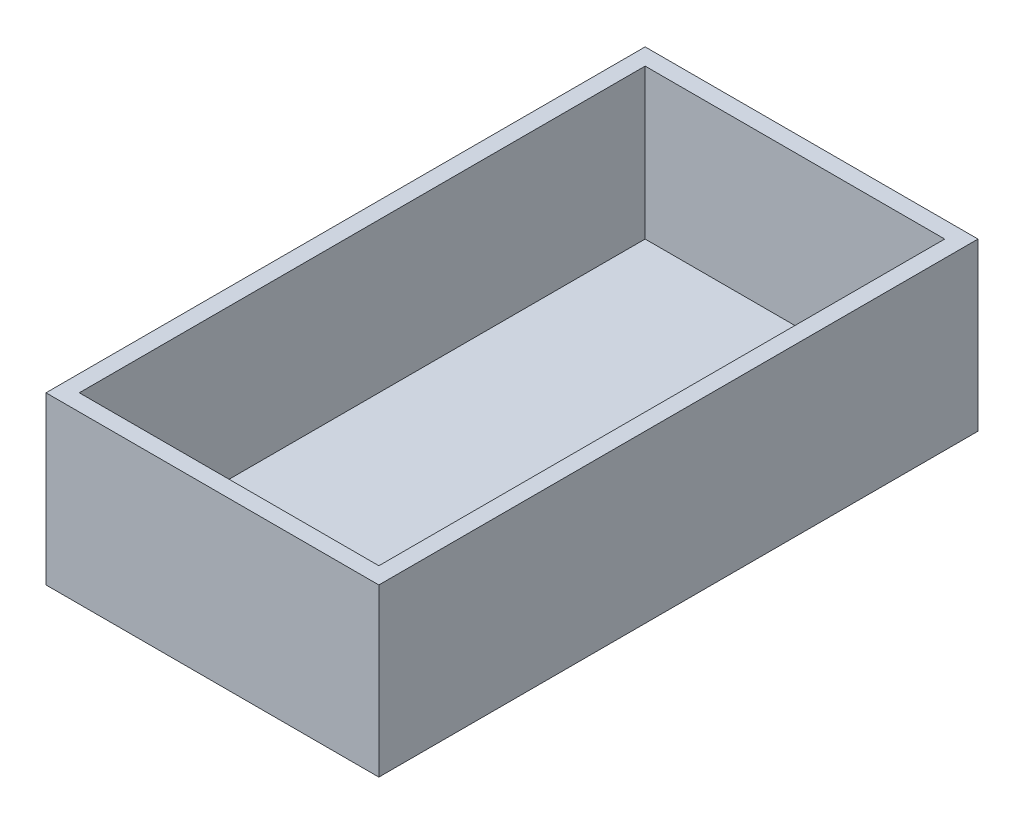
ISO-10303-21;
HEADER;
FILE_DESCRIPTION(('STEP AP214'),'2;1');
FILE_NAME('part.step','',(''),(''),'','','');
FILE_SCHEMA(('AUTOMOTIVE_DESIGN { 1 0 10303 214 1 1 1 1 }'));
ENDSEC;
DATA;
#1=APPLICATION_CONTEXT('core data for automotive mechanical design processes');
#2=APPLICATION_PROTOCOL_DEFINITION('international standard','automotive_design',2000,#1);
#3=PRODUCT_CONTEXT('',#1,'mechanical');
#4=PRODUCT('Part','Part','',(#3));
#5=PRODUCT_RELATED_PRODUCT_CATEGORY('part','',(#4));
#6=PRODUCT_DEFINITION_FORMATION('','',#4);
#7=PRODUCT_DEFINITION_CONTEXT('part definition',#1,'design');
#8=PRODUCT_DEFINITION('design','',#6,#7);
#9=PRODUCT_DEFINITION_SHAPE('','',#8);
#10=(LENGTH_UNIT() NAMED_UNIT(*) SI_UNIT(.MILLI.,.METRE.));
#11=(NAMED_UNIT(*) PLANE_ANGLE_UNIT() SI_UNIT($,.RADIAN.));
#12=(NAMED_UNIT(*) SI_UNIT($,.STERADIAN.) SOLID_ANGLE_UNIT());
#13=UNCERTAINTY_MEASURE_WITH_UNIT(LENGTH_MEASURE(1.E-05),#10,'distance_accuracy_value','');
#14=(GEOMETRIC_REPRESENTATION_CONTEXT(3) GLOBAL_UNCERTAINTY_ASSIGNED_CONTEXT((#13)) GLOBAL_UNIT_ASSIGNED_CONTEXT((#10,
#11,#12)) REPRESENTATION_CONTEXT('',''));
#15=CARTESIAN_POINT('',(0.,0.,0.));
#16=DIRECTION('',(0.,0.,1.));
#17=DIRECTION('',(1.,0.,0.));
#18=AXIS2_PLACEMENT_3D('',#15,#16,#17);
#19=CARTESIAN_POINT('',(20.,20.,-36.));
#20=DIRECTION('',(-1.,0.,0.));
#21=DIRECTION('',(0.,0.,1.));
#22=AXIS2_PLACEMENT_3D('',#19,#20,#21);
#23=PLANE('',#22);
#24=DIRECTION('',(0.,0.,-1.));
#25=VECTOR('',#24,1.);
#26=CARTESIAN_POINT('',(20.,0.,-36.));
#27=LINE('',#26,#25);
#28=CARTESIAN_POINT('',(20.,0.,36.));
#29=VERTEX_POINT('',#28);
#30=CARTESIAN_POINT('',(20.,0.,-36.));
#31=VERTEX_POINT('',#30);
#32=EDGE_CURVE('E147',#29,#31,#27,.T.);
#33=ORIENTED_EDGE('',*,*,#32,.T.);
#34=DIRECTION('',(0.,-1.,0.));
#35=VECTOR('',#34,1.);
#36=CARTESIAN_POINT('',(20.,20.,-36.));
#37=LINE('',#36,#35);
#38=CARTESIAN_POINT('',(20.,20.,-36.));
#39=VERTEX_POINT('',#38);
#40=EDGE_CURVE('E11',#39,#31,#37,.T.);
#41=ORIENTED_EDGE('',*,*,#40,.F.);
#42=DIRECTION('',(0.,0.,-1.));
#43=VECTOR('',#42,1.);
#44=CARTESIAN_POINT('',(20.,20.,-36.));
#45=LINE('',#44,#43);
#46=CARTESIAN_POINT('',(20.,20.,36.));
#47=VERTEX_POINT('',#46);
#48=EDGE_CURVE('E140',#47,#39,#45,.T.);
#49=ORIENTED_EDGE('',*,*,#48,.F.);
#50=DIRECTION('',(0.,-1.,0.));
#51=VECTOR('',#50,1.);
#52=CARTESIAN_POINT('',(20.,20.,36.));
#53=LINE('',#52,#51);
#54=EDGE_CURVE('E146',#47,#29,#53,.T.);
#55=ORIENTED_EDGE('',*,*,#54,.T.);
#56=EDGE_LOOP('',(#33,#41,#49,#55));
#57=FACE_BOUND('',#56,.T.);
#58=ADVANCED_FACE('F33',(#57),#23,.F.);
#59=CARTESIAN_POINT('',(-20.,20.,-36.));
#60=DIRECTION('',(0.,0.,1.));
#61=DIRECTION('',(1.,0.,0.));
#62=AXIS2_PLACEMENT_3D('',#59,#60,#61);
#63=PLANE('',#62);
#64=DIRECTION('',(-1.,0.,0.));
#65=VECTOR('',#64,1.);
#66=CARTESIAN_POINT('',(-20.,0.,-36.));
#67=LINE('',#66,#65);
#68=CARTESIAN_POINT('',(-20.,0.,-36.));
#69=VERTEX_POINT('',#68);
#70=EDGE_CURVE('E150',#31,#69,#67,.T.);
#71=ORIENTED_EDGE('',*,*,#70,.T.);
#72=DIRECTION('',(0.,-1.,0.));
#73=VECTOR('',#72,1.);
#74=CARTESIAN_POINT('',(-20.,20.,-36.));
#75=LINE('',#74,#73);
#76=CARTESIAN_POINT('',(-20.,20.,-36.));
#77=VERTEX_POINT('',#76);
#78=EDGE_CURVE('E40',#77,#69,#75,.T.);
#79=ORIENTED_EDGE('',*,*,#78,.F.);
#80=DIRECTION('',(-1.,0.,0.));
#81=VECTOR('',#80,1.);
#82=CARTESIAN_POINT('',(-20.,20.,-36.));
#83=LINE('',#82,#81);
#84=EDGE_CURVE('E84',#39,#77,#83,.T.);
#85=ORIENTED_EDGE('',*,*,#84,.F.);
#86=ORIENTED_EDGE('',*,*,#40,.T.);
#87=EDGE_LOOP('',(#71,#79,#85,#86));
#88=FACE_BOUND('',#87,.T.);
#89=ADVANCED_FACE('F179',(#88),#63,.F.);
#90=CARTESIAN_POINT('',(-20.,20.,-36.));
#91=DIRECTION('',(1.,0.,0.));
#92=DIRECTION('',(0.,0.,-1.));
#93=AXIS2_PLACEMENT_3D('',#90,#91,#92);
#94=PLANE('',#93);
#95=DIRECTION('',(0.,0.,1.));
#96=VECTOR('',#95,1.);
#97=CARTESIAN_POINT('',(-20.,0.,-36.));
#98=LINE('',#97,#96);
#99=CARTESIAN_POINT('',(-20.,0.,36.));
#100=VERTEX_POINT('',#99);
#101=EDGE_CURVE('E152',#69,#100,#98,.T.);
#102=ORIENTED_EDGE('',*,*,#101,.T.);
#103=DIRECTION('',(0.,-1.,0.));
#104=VECTOR('',#103,1.);
#105=CARTESIAN_POINT('',(-20.,20.,36.));
#106=LINE('',#105,#104);
#107=CARTESIAN_POINT('',(-20.,20.,36.));
#108=VERTEX_POINT('',#107);
#109=EDGE_CURVE('E156',#108,#100,#106,.T.);
#110=ORIENTED_EDGE('',*,*,#109,.F.);
#111=DIRECTION('',(0.,0.,1.));
#112=VECTOR('',#111,1.);
#113=CARTESIAN_POINT('',(-20.,20.,-36.));
#114=LINE('',#113,#112);
#115=EDGE_CURVE('E143',#77,#108,#114,.T.);
#116=ORIENTED_EDGE('',*,*,#115,.F.);
#117=ORIENTED_EDGE('',*,*,#78,.T.);
#118=EDGE_LOOP('',(#102,#110,#116,#117));
#119=FACE_BOUND('',#118,.T.);
#120=ADVANCED_FACE('F161',(#119),#94,.F.);
#121=CARTESIAN_POINT('',(-20.,20.,36.));
#122=DIRECTION('',(0.,0.,-1.));
#123=DIRECTION('',(-1.,0.,0.));
#124=AXIS2_PLACEMENT_3D('',#121,#122,#123);
#125=PLANE('',#124);
#126=DIRECTION('',(1.,0.,0.));
#127=VECTOR('',#126,1.);
#128=CARTESIAN_POINT('',(-20.,0.,36.));
#129=LINE('',#128,#127);
#130=EDGE_CURVE('E77',#100,#29,#129,.T.);
#131=ORIENTED_EDGE('',*,*,#130,.T.);
#132=ORIENTED_EDGE('',*,*,#54,.F.);
#133=DIRECTION('',(1.,0.,0.));
#134=VECTOR('',#133,1.);
#135=CARTESIAN_POINT('',(-20.,20.,36.));
#136=LINE('',#135,#134);
#137=EDGE_CURVE('E56',#108,#47,#136,.T.);
#138=ORIENTED_EDGE('',*,*,#137,.F.);
#139=ORIENTED_EDGE('',*,*,#109,.T.);
#140=EDGE_LOOP('',(#131,#132,#138,#139));
#141=FACE_BOUND('',#140,.T.);
#142=ADVANCED_FACE('F169',(#141),#125,.F.);
#143=CARTESIAN_POINT('',(0.,20.,0.));
#144=DIRECTION('',(0.,1.,0.));
#145=DIRECTION('',(0.,0.,1.));
#146=AXIS2_PLACEMENT_3D('',#143,#144,#145);
#147=PLANE('',#146);
#148=DIRECTION('',(0.,0.,-1.));
#149=VECTOR('',#148,1.);
#150=CARTESIAN_POINT('',(18.,20.,-36.));
#151=LINE('',#150,#149);
#152=CARTESIAN_POINT('',(18.,20.,34.));
#153=VERTEX_POINT('',#152);
#154=CARTESIAN_POINT('',(18.,20.,-34.));
#155=VERTEX_POINT('',#154);
#156=EDGE_CURVE('E129',#153,#155,#151,.T.);
#157=ORIENTED_EDGE('',*,*,#156,.F.);
#158=DIRECTION('',(1.,0.,0.));
#159=VECTOR('',#158,1.);
#160=CARTESIAN_POINT('',(-20.,20.,34.));
#161=LINE('',#160,#159);
#162=CARTESIAN_POINT('',(-18.,20.,34.));
#163=VERTEX_POINT('',#162);
#164=EDGE_CURVE('E138',#163,#153,#161,.T.);
#165=ORIENTED_EDGE('',*,*,#164,.F.);
#166=DIRECTION('',(0.,0.,1.));
#167=VECTOR('',#166,1.);
#168=CARTESIAN_POINT('',(-18.,20.,-36.));
#169=LINE('',#168,#167);
#170=CARTESIAN_POINT('',(-18.,20.,-34.));
#171=VERTEX_POINT('',#170);
#172=EDGE_CURVE('E136',#171,#163,#169,.T.);
#173=ORIENTED_EDGE('',*,*,#172,.F.);
#174=DIRECTION('',(-1.,0.,0.));
#175=VECTOR('',#174,1.);
#176=CARTESIAN_POINT('',(-20.,20.,-34.));
#177=LINE('',#176,#175);
#178=EDGE_CURVE('E121',#155,#171,#177,.T.);
#179=ORIENTED_EDGE('',*,*,#178,.F.);
#180=EDGE_LOOP('',(#157,#165,#173,#179));
#181=FACE_BOUND('',#180,.T.);
#182=ORIENTED_EDGE('',*,*,#48,.T.);
#183=ORIENTED_EDGE('',*,*,#84,.T.);
#184=ORIENTED_EDGE('',*,*,#115,.T.);
#185=ORIENTED_EDGE('',*,*,#137,.T.);
#186=EDGE_LOOP('',(#182,#183,#184,#185));
#187=FACE_BOUND('',#186,.T.);
#188=ADVANCED_FACE('F171',(#181,#187),#147,.T.);
#189=CARTESIAN_POINT('',(0.,0.,0.));
#190=DIRECTION('',(0.,1.,0.));
#191=DIRECTION('',(0.,0.,1.));
#192=AXIS2_PLACEMENT_3D('',#189,#190,#191);
#193=PLANE('',#192);
#194=ORIENTED_EDGE('',*,*,#32,.F.);
#195=ORIENTED_EDGE('',*,*,#130,.F.);
#196=ORIENTED_EDGE('',*,*,#101,.F.);
#197=ORIENTED_EDGE('',*,*,#70,.F.);
#198=EDGE_LOOP('',(#194,#195,#196,#197));
#199=FACE_BOUND('',#198,.T.);
#200=ADVANCED_FACE('F165',(#199),#193,.F.);
#201=CARTESIAN_POINT('',(18.,20.,-36.));
#202=DIRECTION('',(-1.,0.,0.));
#203=DIRECTION('',(0.,0.,1.));
#204=AXIS2_PLACEMENT_3D('',#201,#202,#203);
#205=PLANE('',#204);
#206=DIRECTION('',(0.,0.,-1.));
#207=VECTOR('',#206,1.);
#208=CARTESIAN_POINT('',(18.,2.,-36.));
#209=LINE('',#208,#207);
#210=CARTESIAN_POINT('',(18.,2.,34.));
#211=VERTEX_POINT('',#210);
#212=CARTESIAN_POINT('',(18.,2.,-34.));
#213=VERTEX_POINT('',#212);
#214=EDGE_CURVE('E112',#211,#213,#209,.T.);
#215=ORIENTED_EDGE('',*,*,#214,.F.);
#216=DIRECTION('',(0.,-1.,0.));
#217=VECTOR('',#216,1.);
#218=CARTESIAN_POINT('',(18.,20.,34.));
#219=LINE('',#218,#217);
#220=EDGE_CURVE('E132',#153,#211,#219,.T.);
#221=ORIENTED_EDGE('',*,*,#220,.F.);
#222=ORIENTED_EDGE('',*,*,#156,.T.);
#223=DIRECTION('',(0.,-1.,0.));
#224=VECTOR('',#223,1.);
#225=CARTESIAN_POINT('',(18.,20.,-34.));
#226=LINE('',#225,#224);
#227=EDGE_CURVE('E124',#155,#213,#226,.T.);
#228=ORIENTED_EDGE('',*,*,#227,.T.);
#229=EDGE_LOOP('',(#215,#221,#222,#228));
#230=FACE_BOUND('',#229,.T.);
#231=ADVANCED_FACE('F206',(#230),#205,.T.);
#232=CARTESIAN_POINT('',(-20.,20.,-34.));
#233=DIRECTION('',(0.,0.,1.));
#234=DIRECTION('',(1.,0.,0.));
#235=AXIS2_PLACEMENT_3D('',#232,#233,#234);
#236=PLANE('',#235);
#237=DIRECTION('',(-1.,0.,0.));
#238=VECTOR('',#237,1.);
#239=CARTESIAN_POINT('',(-20.,2.,-34.));
#240=LINE('',#239,#238);
#241=CARTESIAN_POINT('',(-18.,2.,-34.));
#242=VERTEX_POINT('',#241);
#243=EDGE_CURVE('E106',#213,#242,#240,.T.);
#244=ORIENTED_EDGE('',*,*,#243,.F.);
#245=ORIENTED_EDGE('',*,*,#227,.F.);
#246=ORIENTED_EDGE('',*,*,#178,.T.);
#247=DIRECTION('',(0.,-1.,0.));
#248=VECTOR('',#247,1.);
#249=CARTESIAN_POINT('',(-18.,20.,-34.));
#250=LINE('',#249,#248);
#251=EDGE_CURVE('E118',#171,#242,#250,.T.);
#252=ORIENTED_EDGE('',*,*,#251,.T.);
#253=EDGE_LOOP('',(#244,#245,#246,#252));
#254=FACE_BOUND('',#253,.T.);
#255=ADVANCED_FACE('F119',(#254),#236,.T.);
#256=CARTESIAN_POINT('',(-18.,20.,-36.));
#257=DIRECTION('',(1.,0.,0.));
#258=DIRECTION('',(0.,0.,-1.));
#259=AXIS2_PLACEMENT_3D('',#256,#257,#258);
#260=PLANE('',#259);
#261=DIRECTION('',(0.,0.,1.));
#262=VECTOR('',#261,1.);
#263=CARTESIAN_POINT('',(-18.,2.,-36.));
#264=LINE('',#263,#262);
#265=CARTESIAN_POINT('',(-18.,2.,34.));
#266=VERTEX_POINT('',#265);
#267=EDGE_CURVE('E110',#242,#266,#264,.T.);
#268=ORIENTED_EDGE('',*,*,#267,.F.);
#269=ORIENTED_EDGE('',*,*,#251,.F.);
#270=ORIENTED_EDGE('',*,*,#172,.T.);
#271=DIRECTION('',(0.,-1.,0.));
#272=VECTOR('',#271,1.);
#273=CARTESIAN_POINT('',(-18.,20.,34.));
#274=LINE('',#273,#272);
#275=EDGE_CURVE('E47',#163,#266,#274,.T.);
#276=ORIENTED_EDGE('',*,*,#275,.T.);
#277=EDGE_LOOP('',(#268,#269,#270,#276));
#278=FACE_BOUND('',#277,.T.);
#279=ADVANCED_FACE('F126',(#278),#260,.T.);
#280=CARTESIAN_POINT('',(-20.,20.,34.));
#281=DIRECTION('',(0.,0.,-1.));
#282=DIRECTION('',(-1.,0.,0.));
#283=AXIS2_PLACEMENT_3D('',#280,#281,#282);
#284=PLANE('',#283);
#285=DIRECTION('',(1.,0.,0.));
#286=VECTOR('',#285,1.);
#287=CARTESIAN_POINT('',(-20.,2.,34.));
#288=LINE('',#287,#286);
#289=EDGE_CURVE('E127',#266,#211,#288,.T.);
#290=ORIENTED_EDGE('',*,*,#289,.F.);
#291=ORIENTED_EDGE('',*,*,#275,.F.);
#292=ORIENTED_EDGE('',*,*,#164,.T.);
#293=ORIENTED_EDGE('',*,*,#220,.T.);
#294=EDGE_LOOP('',(#290,#291,#292,#293));
#295=FACE_BOUND('',#294,.T.);
#296=ADVANCED_FACE('F236',(#295),#284,.T.);
#297=CARTESIAN_POINT('',(0.,2.,0.));
#298=DIRECTION('',(0.,1.,0.));
#299=DIRECTION('',(0.,0.,1.));
#300=AXIS2_PLACEMENT_3D('',#297,#298,#299);
#301=PLANE('',#300);
#302=ORIENTED_EDGE('',*,*,#214,.T.);
#303=ORIENTED_EDGE('',*,*,#243,.T.);
#304=ORIENTED_EDGE('',*,*,#267,.T.);
#305=ORIENTED_EDGE('',*,*,#289,.T.);
#306=EDGE_LOOP('',(#302,#303,#304,#305));
#307=FACE_BOUND('',#306,.T.);
#308=ADVANCED_FACE('F108',(#307),#301,.T.);
#309=CLOSED_SHELL('',(#58,#89,#120,#142,#188,#200,#231,#255,#279,#296,#308));
#310=MANIFOLD_SOLID_BREP('B2',#309);
#311=ADVANCED_BREP_SHAPE_REPRESENTATION('',(#18,#310),#14);
#312=SHAPE_DEFINITION_REPRESENTATION(#9,#311);
ENDSEC;
END-ISO-10303-21;
